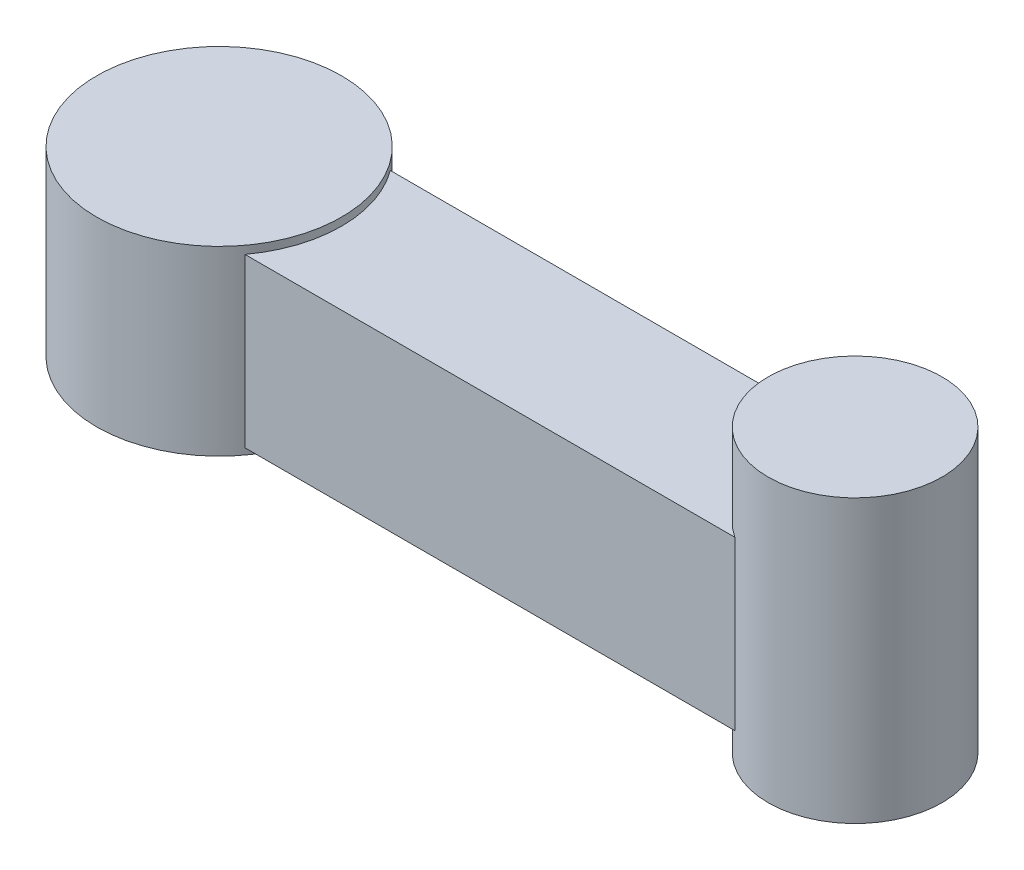
ISO-10303-21;
HEADER;
FILE_DESCRIPTION(('STEP AP214'),'2;1');
FILE_NAME('part.step','',(''),(''),'','','');
FILE_SCHEMA(('AUTOMOTIVE_DESIGN { 1 0 10303 214 1 1 1 1 }'));
ENDSEC;
DATA;
#1=APPLICATION_CONTEXT('core data for automotive mechanical design processes');
#2=APPLICATION_PROTOCOL_DEFINITION('international standard','automotive_design',2000,#1);
#3=PRODUCT_CONTEXT('',#1,'mechanical');
#4=PRODUCT('Part','Part','',(#3));
#5=PRODUCT_RELATED_PRODUCT_CATEGORY('part','',(#4));
#6=PRODUCT_DEFINITION_FORMATION('','',#4);
#7=PRODUCT_DEFINITION_CONTEXT('part definition',#1,'design');
#8=PRODUCT_DEFINITION('design','',#6,#7);
#9=PRODUCT_DEFINITION_SHAPE('','',#8);
#10=(LENGTH_UNIT() NAMED_UNIT(*) SI_UNIT(.MILLI.,.METRE.));
#11=(NAMED_UNIT(*) PLANE_ANGLE_UNIT() SI_UNIT($,.RADIAN.));
#12=(NAMED_UNIT(*) SI_UNIT($,.STERADIAN.) SOLID_ANGLE_UNIT());
#13=UNCERTAINTY_MEASURE_WITH_UNIT(LENGTH_MEASURE(1.E-05),#10,'distance_accuracy_value','');
#14=(GEOMETRIC_REPRESENTATION_CONTEXT(3) GLOBAL_UNCERTAINTY_ASSIGNED_CONTEXT((#13)) GLOBAL_UNIT_ASSIGNED_CONTEXT((#10,
#11,#12)) REPRESENTATION_CONTEXT('',''));
#15=CARTESIAN_POINT('',(0.,0.,0.));
#16=DIRECTION('',(0.,0.,1.));
#17=DIRECTION('',(1.,0.,0.));
#18=AXIS2_PLACEMENT_3D('',#15,#16,#17);
#19=CARTESIAN_POINT('',(0.,106.,0.));
#20=DIRECTION('',(0.,-1.,0.));
#21=DIRECTION('',(0.,0.,-1.));
#22=AXIS2_PLACEMENT_3D('',#19,#20,#21);
#23=CYLINDRICAL_SURFACE('',#22,77.5);
#24=DIRECTION('',(0.,-1.,0.));
#25=VECTOR('',#24,1.);
#26=CARTESIAN_POINT('',(62.3718686588754,106.,-46.));
#27=LINE('',#26,#25);
#28=CARTESIAN_POINT('',(62.3718686588754,106.,-46.));
#29=VERTEX_POINT('',#28);
#30=CARTESIAN_POINT('',(62.3718686588754,0.,-46.));
#31=VERTEX_POINT('',#30);
#32=EDGE_CURVE('E100',#29,#31,#27,.T.);
#33=ORIENTED_EDGE('',*,*,#32,.T.);
#34=CARTESIAN_POINT('',(0.,0.,0.));
#35=DIRECTION('',(0.,1.,0.));
#36=DIRECTION('',(0.,0.,1.));
#37=AXIS2_PLACEMENT_3D('',#34,#35,#36);
#38=CIRCLE('',#37,77.5);
#39=CARTESIAN_POINT('',(62.3718686588754,0.,46.));
#40=VERTEX_POINT('',#39);
#41=EDGE_CURVE('E44',#40,#31,#38,.T.);
#42=ORIENTED_EDGE('',*,*,#41,.F.);
#43=DIRECTION('',(0.,-1.,0.));
#44=VECTOR('',#43,1.);
#45=CARTESIAN_POINT('',(62.3718686588754,106.,46.));
#46=LINE('',#45,#44);
#47=CARTESIAN_POINT('',(62.3718686588753,106.,46.));
#48=VERTEX_POINT('',#47);
#49=EDGE_CURVE('E69',#48,#40,#46,.T.);
#50=ORIENTED_EDGE('',*,*,#49,.F.);
#51=CARTESIAN_POINT('',(0.,106.,0.));
#52=DIRECTION('',(0.,1.,0.));
#53=DIRECTION('',(0.,0.,1.));
#54=AXIS2_PLACEMENT_3D('',#51,#52,#53);
#55=CIRCLE('',#54,77.5);
#56=EDGE_CURVE('E92',#48,#29,#55,.T.);
#57=ORIENTED_EDGE('',*,*,#56,.T.);
#58=EDGE_LOOP('',(#33,#42,#50,#57));
#59=FACE_BOUND('',#58,.T.);
#60=CARTESIAN_POINT('',(0.,-4.,0.));
#61=DIRECTION('',(0.,1.,0.));
#62=DIRECTION('',(0.,0.,1.));
#63=AXIS2_PLACEMENT_3D('',#60,#61,#62);
#64=CIRCLE('',#63,77.5);
#65=CARTESIAN_POINT('',(0.,-4.,77.5));
#66=VERTEX_POINT('',#65);
#67=EDGE_CURVE('E112',#66,#66,#64,.T.);
#68=ORIENTED_EDGE('',*,*,#67,.T.);
#69=EDGE_LOOP('',(#68));
#70=FACE_BOUND('',#69,.T.);
#71=CARTESIAN_POINT('',(0.,111.,0.));
#72=DIRECTION('',(0.,1.,0.));
#73=DIRECTION('',(0.,0.,1.));
#74=AXIS2_PLACEMENT_3D('',#71,#72,#73);
#75=CIRCLE('',#74,77.5);
#76=CARTESIAN_POINT('',(0.,111.,77.5));
#77=VERTEX_POINT('',#76);
#78=EDGE_CURVE('E115',#77,#77,#75,.T.);
#79=ORIENTED_EDGE('',*,*,#78,.F.);
#80=EDGE_LOOP('',(#79));
#81=FACE_BOUND('',#80,.T.);
#82=ADVANCED_FACE('F36',(#59,#70,#81),#23,.T.);
#83=CARTESIAN_POINT('',(62.3718686588754,106.,46.));
#84=DIRECTION('',(0.,0.,-1.));
#85=DIRECTION('',(-1.,0.,0.));
#86=AXIS2_PLACEMENT_3D('',#83,#84,#85);
#87=PLANE('',#86);
#88=DIRECTION('',(1.,0.,0.));
#89=VECTOR('',#88,1.);
#90=CARTESIAN_POINT('',(62.3718686588754,0.,46.));
#91=LINE('',#90,#89);
#92=CARTESIAN_POINT('',(372.350129794015,0.,46.));
#93=VERTEX_POINT('',#92);
#94=EDGE_CURVE('E80',#40,#93,#91,.T.);
#95=ORIENTED_EDGE('',*,*,#94,.T.);
#96=DIRECTION('',(0.,-1.,0.));
#97=VECTOR('',#96,1.);
#98=CARTESIAN_POINT('',(372.350129794015,106.,46.));
#99=LINE('',#98,#97);
#100=CARTESIAN_POINT('',(372.350129794015,106.,46.));
#101=VERTEX_POINT('',#100);
#102=EDGE_CURVE('E90',#101,#93,#99,.T.);
#103=ORIENTED_EDGE('',*,*,#102,.F.);
#104=DIRECTION('',(1.,0.,0.));
#105=VECTOR('',#104,1.);
#106=CARTESIAN_POINT('',(62.3718686588754,106.,46.));
#107=LINE('',#106,#105);
#108=EDGE_CURVE('E105',#48,#101,#107,.T.);
#109=ORIENTED_EDGE('',*,*,#108,.F.);
#110=ORIENTED_EDGE('',*,*,#49,.T.);
#111=EDGE_LOOP('',(#95,#103,#109,#110));
#112=FACE_BOUND('',#111,.T.);
#113=ADVANCED_FACE('F89',(#112),#87,.F.);
#114=CARTESIAN_POINT('',(402.499756657378,106.,0.));
#115=DIRECTION('',(0.,-1.,0.));
#116=DIRECTION('',(0.,0.,-1.));
#117=AXIS2_PLACEMENT_3D('',#114,#115,#116);
#118=CYLINDRICAL_SURFACE('',#117,55.);
#119=ORIENTED_EDGE('',*,*,#102,.T.);
#120=CARTESIAN_POINT('',(402.499756657378,0.,0.));
#121=DIRECTION('',(0.,1.,0.));
#122=DIRECTION('',(0.,0.,1.));
#123=AXIS2_PLACEMENT_3D('',#120,#121,#122);
#124=CIRCLE('',#123,54.9999999999999);
#125=CARTESIAN_POINT('',(372.350129794015,0.,-46.));
#126=VERTEX_POINT('',#125);
#127=EDGE_CURVE('E11',#126,#93,#124,.T.);
#128=ORIENTED_EDGE('',*,*,#127,.F.);
#129=DIRECTION('',(0.,-1.,0.));
#130=VECTOR('',#129,1.);
#131=CARTESIAN_POINT('',(372.350129794015,106.,-46.));
#132=LINE('',#131,#130);
#133=CARTESIAN_POINT('',(372.350129794015,106.,-46.));
#134=VERTEX_POINT('',#133);
#135=EDGE_CURVE('E97',#134,#126,#132,.T.);
#136=ORIENTED_EDGE('',*,*,#135,.F.);
#137=CARTESIAN_POINT('',(402.499756657378,106.,0.));
#138=DIRECTION('',(0.,1.,0.));
#139=DIRECTION('',(0.,0.,1.));
#140=AXIS2_PLACEMENT_3D('',#137,#138,#139);
#141=CIRCLE('',#140,54.9999999999999);
#142=EDGE_CURVE('E96',#134,#101,#141,.T.);
#143=ORIENTED_EDGE('',*,*,#142,.T.);
#144=EDGE_LOOP('',(#119,#128,#136,#143));
#145=FACE_BOUND('',#144,.T.);
#146=CARTESIAN_POINT('',(402.499756657378,-20.,0.));
#147=DIRECTION('',(0.,1.,0.));
#148=DIRECTION('',(0.,0.,1.));
#149=AXIS2_PLACEMENT_3D('',#146,#147,#148);
#150=CIRCLE('',#149,54.9999999999999);
#151=CARTESIAN_POINT('',(402.499756657378,-20.,54.9999999999999));
#152=VERTEX_POINT('',#151);
#153=EDGE_CURVE('E119',#152,#152,#150,.T.);
#154=ORIENTED_EDGE('',*,*,#153,.T.);
#155=EDGE_LOOP('',(#154));
#156=FACE_BOUND('',#155,.T.);
#157=CARTESIAN_POINT('',(402.499756657378,158.5,0.));
#158=DIRECTION('',(0.,1.,0.));
#159=DIRECTION('',(0.,0.,1.));
#160=AXIS2_PLACEMENT_3D('',#157,#158,#159);
#161=CIRCLE('',#160,54.9999999999999);
#162=CARTESIAN_POINT('',(402.499756657378,158.5,54.9999999999999));
#163=VERTEX_POINT('',#162);
#164=EDGE_CURVE('E122',#163,#163,#161,.T.);
#165=ORIENTED_EDGE('',*,*,#164,.F.);
#166=EDGE_LOOP('',(#165));
#167=FACE_BOUND('',#166,.T.);
#168=ADVANCED_FACE('F94',(#145,#156,#167),#118,.T.);
#169=CARTESIAN_POINT('',(62.3718686588754,106.,-46.));
#170=DIRECTION('',(0.,0.,1.));
#171=DIRECTION('',(1.,0.,0.));
#172=AXIS2_PLACEMENT_3D('',#169,#170,#171);
#173=PLANE('',#172);
#174=DIRECTION('',(-1.,0.,0.));
#175=VECTOR('',#174,1.);
#176=CARTESIAN_POINT('',(62.3718686588754,0.,-46.));
#177=LINE('',#176,#175);
#178=EDGE_CURVE('E82',#126,#31,#177,.T.);
#179=ORIENTED_EDGE('',*,*,#178,.T.);
#180=ORIENTED_EDGE('',*,*,#32,.F.);
#181=DIRECTION('',(-1.,0.,0.));
#182=VECTOR('',#181,1.);
#183=CARTESIAN_POINT('',(62.3718686588754,106.,-46.));
#184=LINE('',#183,#182);
#185=EDGE_CURVE('E52',#134,#29,#184,.T.);
#186=ORIENTED_EDGE('',*,*,#185,.F.);
#187=ORIENTED_EDGE('',*,*,#135,.T.);
#188=EDGE_LOOP('',(#179,#180,#186,#187));
#189=FACE_BOUND('',#188,.T.);
#190=ADVANCED_FACE('F104',(#189),#173,.F.);
#191=CARTESIAN_POINT('',(0.,106.,0.));
#192=DIRECTION('',(0.,1.,0.));
#193=DIRECTION('',(0.,0.,1.));
#194=AXIS2_PLACEMENT_3D('',#191,#192,#193);
#195=PLANE('',#194);
#196=ORIENTED_EDGE('',*,*,#142,.F.);
#197=ORIENTED_EDGE('',*,*,#185,.T.);
#198=ORIENTED_EDGE('',*,*,#56,.F.);
#199=ORIENTED_EDGE('',*,*,#108,.T.);
#200=EDGE_LOOP('',(#196,#197,#198,#199));
#201=FACE_BOUND('',#200,.T.);
#202=ADVANCED_FACE('F134',(#201),#195,.T.);
#203=CARTESIAN_POINT('',(0.,0.,0.));
#204=DIRECTION('',(0.,1.,0.));
#205=DIRECTION('',(0.,0.,1.));
#206=AXIS2_PLACEMENT_3D('',#203,#204,#205);
#207=PLANE('',#206);
#208=ORIENTED_EDGE('',*,*,#178,.F.);
#209=ORIENTED_EDGE('',*,*,#127,.T.);
#210=ORIENTED_EDGE('',*,*,#94,.F.);
#211=ORIENTED_EDGE('',*,*,#41,.T.);
#212=EDGE_LOOP('',(#208,#209,#210,#211));
#213=FACE_BOUND('',#212,.T.);
#214=ADVANCED_FACE('F79',(#213),#207,.F.);
#215=CARTESIAN_POINT('',(0.,-4.,0.));
#216=DIRECTION('',(0.,1.,0.));
#217=DIRECTION('',(0.,0.,1.));
#218=AXIS2_PLACEMENT_3D('',#215,#216,#217);
#219=PLANE('',#218);
#220=ORIENTED_EDGE('',*,*,#67,.F.);
#221=EDGE_LOOP('',(#220));
#222=FACE_BOUND('',#221,.T.);
#223=ADVANCED_FACE('F179',(#222),#219,.F.);
#224=CARTESIAN_POINT('',(0.,111.,0.));
#225=DIRECTION('',(0.,1.,0.));
#226=DIRECTION('',(0.,0.,1.));
#227=AXIS2_PLACEMENT_3D('',#224,#225,#226);
#228=PLANE('',#227);
#229=ORIENTED_EDGE('',*,*,#78,.T.);
#230=EDGE_LOOP('',(#229));
#231=FACE_BOUND('',#230,.T.);
#232=ADVANCED_FACE('F151',(#231),#228,.T.);
#233=CARTESIAN_POINT('',(402.499756657378,-20.,0.));
#234=DIRECTION('',(0.,1.,0.));
#235=DIRECTION('',(0.,0.,1.));
#236=AXIS2_PLACEMENT_3D('',#233,#234,#235);
#237=PLANE('',#236);
#238=ORIENTED_EDGE('',*,*,#153,.F.);
#239=EDGE_LOOP('',(#238));
#240=FACE_BOUND('',#239,.T.);
#241=ADVANCED_FACE('F185',(#240),#237,.F.);
#242=CARTESIAN_POINT('',(402.499756657378,158.5,0.));
#243=DIRECTION('',(0.,1.,0.));
#244=DIRECTION('',(0.,0.,1.));
#245=AXIS2_PLACEMENT_3D('',#242,#243,#244);
#246=PLANE('',#245);
#247=ORIENTED_EDGE('',*,*,#164,.T.);
#248=EDGE_LOOP('',(#247));
#249=FACE_BOUND('',#248,.T.);
#250=ADVANCED_FACE('F126',(#249),#246,.T.);
#251=CLOSED_SHELL('',(#82,#113,#168,#190,#202,#214,#223,#232,#241,#250));
#252=MANIFOLD_SOLID_BREP('B2',#251);
#253=ADVANCED_BREP_SHAPE_REPRESENTATION('',(#18,#252),#14);
#254=SHAPE_DEFINITION_REPRESENTATION(#9,#253);
ENDSEC;
END-ISO-10303-21;
